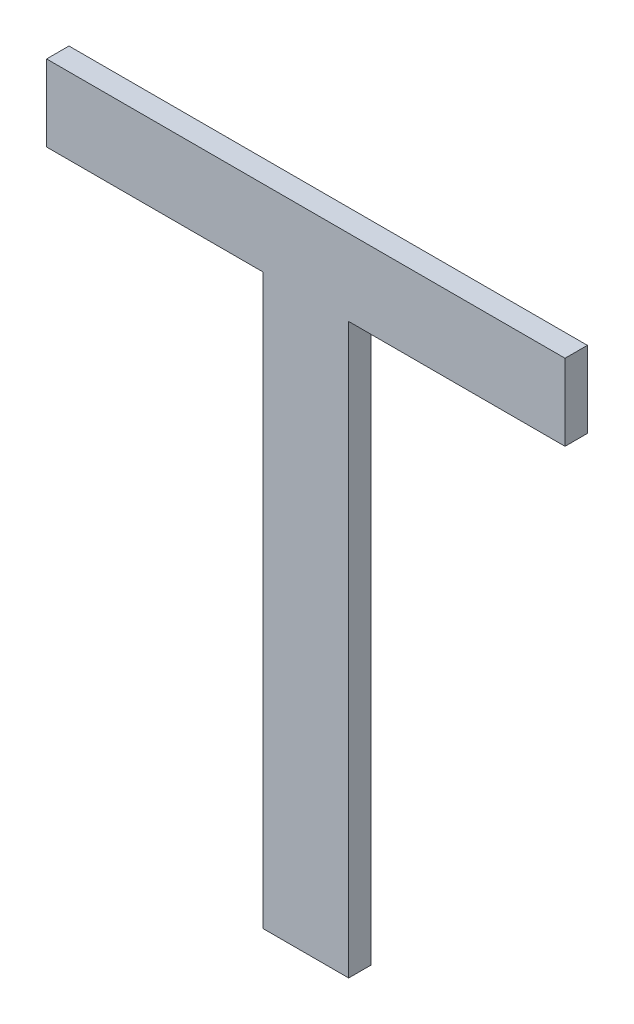
ISO-10303-21;
HEADER;
FILE_DESCRIPTION(('STEP AP214'),'2;1');
FILE_NAME('part.step','',(''),(''),'','','');
FILE_SCHEMA(('AUTOMOTIVE_DESIGN { 1 0 10303 214 1 1 1 1 }'));
ENDSEC;
DATA;
#1=APPLICATION_CONTEXT('core data for automotive mechanical design processes');
#2=APPLICATION_PROTOCOL_DEFINITION('international standard','automotive_design',2000,#1);
#3=PRODUCT_CONTEXT('',#1,'mechanical');
#4=PRODUCT('Part','Part','',(#3));
#5=PRODUCT_RELATED_PRODUCT_CATEGORY('part','',(#4));
#6=PRODUCT_DEFINITION_FORMATION('','',#4);
#7=PRODUCT_DEFINITION_CONTEXT('part definition',#1,'design');
#8=PRODUCT_DEFINITION('design','',#6,#7);
#9=PRODUCT_DEFINITION_SHAPE('','',#8);
#10=(LENGTH_UNIT() NAMED_UNIT(*) SI_UNIT(.MILLI.,.METRE.));
#11=(NAMED_UNIT(*) PLANE_ANGLE_UNIT() SI_UNIT($,.RADIAN.));
#12=(NAMED_UNIT(*) SI_UNIT($,.STERADIAN.) SOLID_ANGLE_UNIT());
#13=UNCERTAINTY_MEASURE_WITH_UNIT(LENGTH_MEASURE(1.E-05),#10,'distance_accuracy_value','');
#14=(GEOMETRIC_REPRESENTATION_CONTEXT(3) GLOBAL_UNCERTAINTY_ASSIGNED_CONTEXT((#13)) GLOBAL_UNIT_ASSIGNED_CONTEXT((#10,
#11,#12)) REPRESENTATION_CONTEXT('',''));
#15=CARTESIAN_POINT('',(0.,0.,0.));
#16=DIRECTION('',(0.,0.,1.));
#17=DIRECTION('',(1.,0.,0.));
#18=AXIS2_PLACEMENT_3D('',#15,#16,#17);
#19=CARTESIAN_POINT('',(-1.20959429009864,-1.30234419699397,0.0042));
#20=DIRECTION('',(0.,0.,1.));
#21=DIRECTION('',(1.,0.,0.));
#22=AXIS2_PLACEMENT_3D('',#19,#20,#21);
#23=PLANE('',#22);
#24=DIRECTION('',(0.,-1.,0.));
#25=VECTOR('',#24,1.);
#26=CARTESIAN_POINT('',(-1.21610644551989,-1.2810089784455,0.0042));
#27=LINE('',#26,#25);
#28=CARTESIAN_POINT('',(-1.21610644551989,-1.2810089784455,0.0042));
#29=VERTEX_POINT('',#28);
#30=CARTESIAN_POINT('',(-1.21610644551989,-1.36741416257148,0.0042));
#31=VERTEX_POINT('',#30);
#32=EDGE_CURVE('E11',#29,#31,#27,.T.);
#33=ORIENTED_EDGE('',*,*,#32,.T.);
#34=DIRECTION('',(1.,0.,0.));
#35=VECTOR('',#34,1.);
#36=CARTESIAN_POINT('',(-1.21610644551989,-1.36741416257148,0.0042));
#37=LINE('',#36,#35);
#38=CARTESIAN_POINT('',(-1.20308213467738,-1.36741416257148,0.0042));
#39=VERTEX_POINT('',#38);
#40=EDGE_CURVE('E95',#31,#39,#37,.T.);
#41=ORIENTED_EDGE('',*,*,#40,.T.);
#42=DIRECTION('',(0.,1.,0.));
#43=VECTOR('',#42,1.);
#44=CARTESIAN_POINT('',(-1.20308213467738,-1.36741416257148,0.0042));
#45=LINE('',#44,#43);
#46=CARTESIAN_POINT('',(-1.20308213467738,-1.2810089784455,0.0042));
#47=VERTEX_POINT('',#46);
#48=EDGE_CURVE('E136',#39,#47,#45,.T.);
#49=ORIENTED_EDGE('',*,*,#48,.T.);
#50=DIRECTION('',(1.,0.,0.));
#51=VECTOR('',#50,1.);
#52=CARTESIAN_POINT('',(-1.20308213467738,-1.2810089784455,0.0042));
#53=LINE('',#52,#51);
#54=CARTESIAN_POINT('',(-1.17020369145297,-1.2810089784455,0.0042));
#55=VERTEX_POINT('',#54);
#56=EDGE_CURVE('E127',#47,#55,#53,.T.);
#57=ORIENTED_EDGE('',*,*,#56,.T.);
#58=DIRECTION('',(0.,1.,0.));
#59=VECTOR('',#58,1.);
#60=CARTESIAN_POINT('',(-1.17020369145297,-1.2810089784455,0.0042));
#61=LINE('',#60,#59);
#62=CARTESIAN_POINT('',(-1.17020369145297,-1.26941416513448,0.0042));
#63=VERTEX_POINT('',#62);
#64=EDGE_CURVE('E117',#55,#63,#61,.T.);
#65=ORIENTED_EDGE('',*,*,#64,.T.);
#66=DIRECTION('',(-1.,0.,0.));
#67=VECTOR('',#66,1.);
#68=CARTESIAN_POINT('',(-1.17020369145297,-1.26941416513448,0.0042));
#69=LINE('',#68,#67);
#70=CARTESIAN_POINT('',(-1.2489848887443,-1.26941416513448,0.0042));
#71=VERTEX_POINT('',#70);
#72=EDGE_CURVE('E109',#63,#71,#69,.T.);
#73=ORIENTED_EDGE('',*,*,#72,.T.);
#74=DIRECTION('',(0.,-1.,0.));
#75=VECTOR('',#74,1.);
#76=CARTESIAN_POINT('',(-1.2489848887443,-1.26941416513448,0.0042));
#77=LINE('',#76,#75);
#78=CARTESIAN_POINT('',(-1.2489848887443,-1.2810089784455,0.0042));
#79=VERTEX_POINT('',#78);
#80=EDGE_CURVE('E119',#71,#79,#77,.T.);
#81=ORIENTED_EDGE('',*,*,#80,.T.);
#82=DIRECTION('',(1.,0.,0.));
#83=VECTOR('',#82,1.);
#84=CARTESIAN_POINT('',(-1.2489848887443,-1.2810089784455,0.0042));
#85=LINE('',#84,#83);
#86=EDGE_CURVE('E129',#79,#29,#85,.T.);
#87=ORIENTED_EDGE('',*,*,#86,.T.);
#88=EDGE_LOOP('',(#33,#41,#49,#57,#65,#73,#81,#87));
#89=FACE_BOUND('',#88,.T.);
#90=ADVANCED_FACE('F17',(#89),#23,.T.);
#91=CARTESIAN_POINT('',(-1.2489848887443,-1.2810089784455,0.0008));
#92=DIRECTION('',(0.,-1.,0.));
#93=DIRECTION('',(1.,0.,0.));
#94=AXIS2_PLACEMENT_3D('',#91,#92,#93);
#95=PLANE('',#94);
#96=DIRECTION('',(-1.,0.,0.));
#97=VECTOR('',#96,1.);
#98=CARTESIAN_POINT('',(-1.21610644551989,-1.2810089784455,0.0008));
#99=LINE('',#98,#97);
#100=CARTESIAN_POINT('',(-1.21610644551989,-1.2810089784455,0.0008));
#101=VERTEX_POINT('',#100);
#102=CARTESIAN_POINT('',(-1.2489848887443,-1.2810089784455,0.0008));
#103=VERTEX_POINT('',#102);
#104=EDGE_CURVE('E24',#101,#103,#99,.T.);
#105=ORIENTED_EDGE('',*,*,#104,.F.);
#106=DIRECTION('',(0.,0.,1.));
#107=VECTOR('',#106,1.);
#108=CARTESIAN_POINT('',(-1.21610644551989,-1.2810089784455,0.0008));
#109=LINE('',#108,#107);
#110=EDGE_CURVE('E84',#101,#29,#109,.T.);
#111=ORIENTED_EDGE('',*,*,#110,.T.);
#112=ORIENTED_EDGE('',*,*,#86,.F.);
#113=DIRECTION('',(0.,0.,1.));
#114=VECTOR('',#113,1.);
#115=CARTESIAN_POINT('',(-1.2489848887443,-1.2810089784455,0.0008));
#116=LINE('',#115,#114);
#117=EDGE_CURVE('E131',#103,#79,#116,.T.);
#118=ORIENTED_EDGE('',*,*,#117,.F.);
#119=EDGE_LOOP('',(#105,#111,#112,#118));
#120=FACE_BOUND('',#119,.T.);
#121=ADVANCED_FACE('F147',(#120),#95,.T.);
#122=CARTESIAN_POINT('',(-1.2489848887443,-1.26941416513448,0.0008));
#123=DIRECTION('',(-1.,0.,0.));
#124=DIRECTION('',(0.,-1.,0.));
#125=AXIS2_PLACEMENT_3D('',#122,#123,#124);
#126=PLANE('',#125);
#127=DIRECTION('',(0.,1.,0.));
#128=VECTOR('',#127,1.);
#129=CARTESIAN_POINT('',(-1.2489848887443,-1.2810089784455,0.0008));
#130=LINE('',#129,#128);
#131=CARTESIAN_POINT('',(-1.2489848887443,-1.26941416513448,0.0008));
#132=VERTEX_POINT('',#131);
#133=EDGE_CURVE('E139',#103,#132,#130,.T.);
#134=ORIENTED_EDGE('',*,*,#133,.F.);
#135=ORIENTED_EDGE('',*,*,#117,.T.);
#136=ORIENTED_EDGE('',*,*,#80,.F.);
#137=DIRECTION('',(0.,0.,1.));
#138=VECTOR('',#137,1.);
#139=CARTESIAN_POINT('',(-1.2489848887443,-1.26941416513448,0.0008));
#140=LINE('',#139,#138);
#141=EDGE_CURVE('E122',#132,#71,#140,.T.);
#142=ORIENTED_EDGE('',*,*,#141,.F.);
#143=EDGE_LOOP('',(#134,#135,#136,#142));
#144=FACE_BOUND('',#143,.T.);
#145=ADVANCED_FACE('F144',(#144),#126,.T.);
#146=CARTESIAN_POINT('',(-1.17020369145297,-1.26941416513448,0.0008));
#147=DIRECTION('',(0.,1.,0.));
#148=DIRECTION('',(-1.,0.,0.));
#149=AXIS2_PLACEMENT_3D('',#146,#147,#148);
#150=PLANE('',#149);
#151=DIRECTION('',(1.,0.,0.));
#152=VECTOR('',#151,1.);
#153=CARTESIAN_POINT('',(-1.2489848887443,-1.26941416513448,0.0008));
#154=LINE('',#153,#152);
#155=CARTESIAN_POINT('',(-1.17020369145297,-1.26941416513448,0.0008));
#156=VERTEX_POINT('',#155);
#157=EDGE_CURVE('E133',#132,#156,#154,.T.);
#158=ORIENTED_EDGE('',*,*,#157,.F.);
#159=ORIENTED_EDGE('',*,*,#141,.T.);
#160=ORIENTED_EDGE('',*,*,#72,.F.);
#161=DIRECTION('',(0.,0.,1.));
#162=VECTOR('',#161,1.);
#163=CARTESIAN_POINT('',(-1.17020369145297,-1.26941416513448,0.0008));
#164=LINE('',#163,#162);
#165=EDGE_CURVE('E112',#156,#63,#164,.T.);
#166=ORIENTED_EDGE('',*,*,#165,.F.);
#167=EDGE_LOOP('',(#158,#159,#160,#166));
#168=FACE_BOUND('',#167,.T.);
#169=ADVANCED_FACE('F152',(#168),#150,.T.);
#170=CARTESIAN_POINT('',(-1.17020369145297,-1.2810089784455,0.0008));
#171=DIRECTION('',(1.,0.,0.));
#172=DIRECTION('',(0.,1.,0.));
#173=AXIS2_PLACEMENT_3D('',#170,#171,#172);
#174=PLANE('',#173);
#175=DIRECTION('',(0.,-1.,0.));
#176=VECTOR('',#175,1.);
#177=CARTESIAN_POINT('',(-1.17020369145297,-1.26941416513448,0.0008));
#178=LINE('',#177,#176);
#179=CARTESIAN_POINT('',(-1.17020369145297,-1.2810089784455,0.0008));
#180=VERTEX_POINT('',#179);
#181=EDGE_CURVE('E124',#156,#180,#178,.T.);
#182=ORIENTED_EDGE('',*,*,#181,.F.);
#183=ORIENTED_EDGE('',*,*,#165,.T.);
#184=ORIENTED_EDGE('',*,*,#64,.F.);
#185=DIRECTION('',(0.,0.,1.));
#186=VECTOR('',#185,1.);
#187=CARTESIAN_POINT('',(-1.17020369145297,-1.2810089784455,0.0008));
#188=LINE('',#187,#186);
#189=EDGE_CURVE('E101',#180,#55,#188,.T.);
#190=ORIENTED_EDGE('',*,*,#189,.F.);
#191=EDGE_LOOP('',(#182,#183,#184,#190));
#192=FACE_BOUND('',#191,.T.);
#193=ADVANCED_FACE('F154',(#192),#174,.T.);
#194=CARTESIAN_POINT('',(-1.20308213467738,-1.2810089784455,0.0008));
#195=DIRECTION('',(0.,-1.,0.));
#196=DIRECTION('',(1.,0.,0.));
#197=AXIS2_PLACEMENT_3D('',#194,#195,#196);
#198=PLANE('',#197);
#199=DIRECTION('',(-1.,0.,0.));
#200=VECTOR('',#199,1.);
#201=CARTESIAN_POINT('',(-1.17020369145297,-1.2810089784455,0.0008));
#202=LINE('',#201,#200);
#203=CARTESIAN_POINT('',(-1.20308213467738,-1.2810089784455,0.0008));
#204=VERTEX_POINT('',#203);
#205=EDGE_CURVE('E115',#180,#204,#202,.T.);
#206=ORIENTED_EDGE('',*,*,#205,.F.);
#207=ORIENTED_EDGE('',*,*,#189,.T.);
#208=ORIENTED_EDGE('',*,*,#56,.F.);
#209=DIRECTION('',(0.,0.,1.));
#210=VECTOR('',#209,1.);
#211=CARTESIAN_POINT('',(-1.20308213467738,-1.2810089784455,0.0008));
#212=LINE('',#211,#210);
#213=EDGE_CURVE('E87',#204,#47,#212,.T.);
#214=ORIENTED_EDGE('',*,*,#213,.F.);
#215=EDGE_LOOP('',(#206,#207,#208,#214));
#216=FACE_BOUND('',#215,.T.);
#217=ADVANCED_FACE('F158',(#216),#198,.T.);
#218=CARTESIAN_POINT('',(-1.20308213467738,-1.36741416257148,0.0008));
#219=DIRECTION('',(1.,0.,0.));
#220=DIRECTION('',(0.,1.,0.));
#221=AXIS2_PLACEMENT_3D('',#218,#219,#220);
#222=PLANE('',#221);
#223=DIRECTION('',(0.,-1.,0.));
#224=VECTOR('',#223,1.);
#225=CARTESIAN_POINT('',(-1.20308213467738,-1.2810089784455,0.0008));
#226=LINE('',#225,#224);
#227=CARTESIAN_POINT('',(-1.20308213467738,-1.36741416257148,0.0008));
#228=VERTEX_POINT('',#227);
#229=EDGE_CURVE('E100',#204,#228,#226,.T.);
#230=ORIENTED_EDGE('',*,*,#229,.F.);
#231=ORIENTED_EDGE('',*,*,#213,.T.);
#232=ORIENTED_EDGE('',*,*,#48,.F.);
#233=DIRECTION('',(0.,0.,1.));
#234=VECTOR('',#233,1.);
#235=CARTESIAN_POINT('',(-1.20308213467738,-1.36741416257148,0.0008));
#236=LINE('',#235,#234);
#237=EDGE_CURVE('E88',#228,#39,#236,.T.);
#238=ORIENTED_EDGE('',*,*,#237,.F.);
#239=EDGE_LOOP('',(#230,#231,#232,#238));
#240=FACE_BOUND('',#239,.T.);
#241=ADVANCED_FACE('F162',(#240),#222,.T.);
#242=CARTESIAN_POINT('',(-1.21610644551989,-1.36741416257148,0.0008));
#243=DIRECTION('',(0.,-1.,0.));
#244=DIRECTION('',(1.,0.,0.));
#245=AXIS2_PLACEMENT_3D('',#242,#243,#244);
#246=PLANE('',#245);
#247=DIRECTION('',(-1.,0.,0.));
#248=VECTOR('',#247,1.);
#249=CARTESIAN_POINT('',(-1.20308213467738,-1.36741416257148,0.0008));
#250=LINE('',#249,#248);
#251=CARTESIAN_POINT('',(-1.21610644551989,-1.36741416257148,0.0008));
#252=VERTEX_POINT('',#251);
#253=EDGE_CURVE('E93',#228,#252,#250,.T.);
#254=ORIENTED_EDGE('',*,*,#253,.F.);
#255=ORIENTED_EDGE('',*,*,#237,.T.);
#256=ORIENTED_EDGE('',*,*,#40,.F.);
#257=DIRECTION('',(0.,0.,1.));
#258=VECTOR('',#257,1.);
#259=CARTESIAN_POINT('',(-1.21610644551989,-1.36741416257148,0.0008));
#260=LINE('',#259,#258);
#261=EDGE_CURVE('E82',#252,#31,#260,.T.);
#262=ORIENTED_EDGE('',*,*,#261,.F.);
#263=EDGE_LOOP('',(#254,#255,#256,#262));
#264=FACE_BOUND('',#263,.T.);
#265=ADVANCED_FACE('F91',(#264),#246,.T.);
#266=CARTESIAN_POINT('',(-1.21610644551989,-1.2810089784455,0.0008));
#267=DIRECTION('',(-1.,0.,0.));
#268=DIRECTION('',(0.,-1.,0.));
#269=AXIS2_PLACEMENT_3D('',#266,#267,#268);
#270=PLANE('',#269);
#271=DIRECTION('',(0.,1.,0.));
#272=VECTOR('',#271,1.);
#273=CARTESIAN_POINT('',(-1.21610644551989,-1.36741416257148,0.0008));
#274=LINE('',#273,#272);
#275=EDGE_CURVE('E79',#252,#101,#274,.T.);
#276=ORIENTED_EDGE('',*,*,#275,.F.);
#277=ORIENTED_EDGE('',*,*,#261,.T.);
#278=ORIENTED_EDGE('',*,*,#32,.F.);
#279=ORIENTED_EDGE('',*,*,#110,.F.);
#280=EDGE_LOOP('',(#276,#277,#278,#279));
#281=FACE_BOUND('',#280,.T.);
#282=ADVANCED_FACE('F81',(#281),#270,.T.);
#283=CARTESIAN_POINT('',(-1.20959429009864,-1.30234419699397,0.0008));
#284=DIRECTION('',(0.,0.,1.));
#285=DIRECTION('',(1.,0.,0.));
#286=AXIS2_PLACEMENT_3D('',#283,#284,#285);
#287=PLANE('',#286);
#288=ORIENTED_EDGE('',*,*,#275,.T.);
#289=ORIENTED_EDGE('',*,*,#104,.T.);
#290=ORIENTED_EDGE('',*,*,#133,.T.);
#291=ORIENTED_EDGE('',*,*,#157,.T.);
#292=ORIENTED_EDGE('',*,*,#181,.T.);
#293=ORIENTED_EDGE('',*,*,#205,.T.);
#294=ORIENTED_EDGE('',*,*,#229,.T.);
#295=ORIENTED_EDGE('',*,*,#253,.T.);
#296=EDGE_LOOP('',(#288,#289,#290,#291,#292,#293,#294,#295));
#297=FACE_BOUND('',#296,.T.);
#298=ADVANCED_FACE('F98',(#297),#287,.F.);
#299=CLOSED_SHELL('',(#90,#121,#145,#169,#193,#217,#241,#265,#282,#298));
#300=MANIFOLD_SOLID_BREP('B1',#299);
#301=ADVANCED_BREP_SHAPE_REPRESENTATION('',(#18,#300),#14);
#302=SHAPE_DEFINITION_REPRESENTATION(#9,#301);
ENDSEC;
END-ISO-10303-21;
